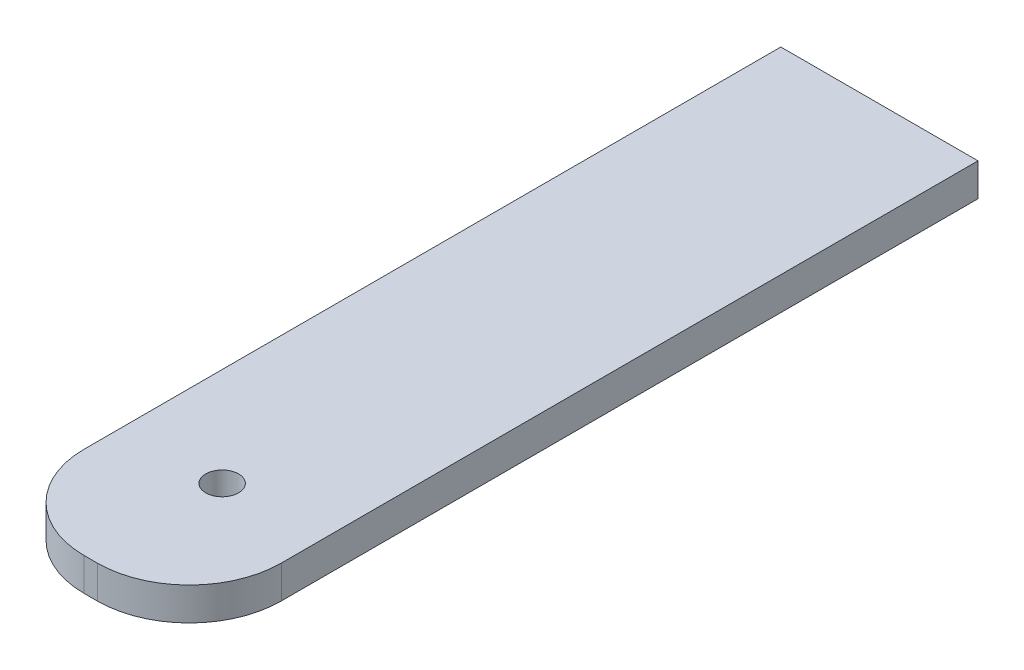
ISO-10303-21;
HEADER;
FILE_DESCRIPTION(('STEP AP214'),'2;1');
FILE_NAME('part.step','',(''),(''),'','','');
FILE_SCHEMA(('AUTOMOTIVE_DESIGN { 1 0 10303 214 1 1 1 1 }'));
ENDSEC;
DATA;
#1=APPLICATION_CONTEXT('core data for automotive mechanical design processes');
#2=APPLICATION_PROTOCOL_DEFINITION('international standard','automotive_design',2000,#1);
#3=PRODUCT_CONTEXT('',#1,'mechanical');
#4=PRODUCT('Part','Part','',(#3));
#5=PRODUCT_RELATED_PRODUCT_CATEGORY('part','',(#4));
#6=PRODUCT_DEFINITION_FORMATION('','',#4);
#7=PRODUCT_DEFINITION_CONTEXT('part definition',#1,'design');
#8=PRODUCT_DEFINITION('design','',#6,#7);
#9=PRODUCT_DEFINITION_SHAPE('','',#8);
#10=(LENGTH_UNIT() NAMED_UNIT(*) SI_UNIT(.MILLI.,.METRE.));
#11=(NAMED_UNIT(*) PLANE_ANGLE_UNIT() SI_UNIT($,.RADIAN.));
#12=(NAMED_UNIT(*) SI_UNIT($,.STERADIAN.) SOLID_ANGLE_UNIT());
#13=UNCERTAINTY_MEASURE_WITH_UNIT(LENGTH_MEASURE(1.E-05),#10,'distance_accuracy_value','');
#14=(GEOMETRIC_REPRESENTATION_CONTEXT(3) GLOBAL_UNCERTAINTY_ASSIGNED_CONTEXT((#13)) GLOBAL_UNIT_ASSIGNED_CONTEXT((#10,
#11,#12)) REPRESENTATION_CONTEXT('',''));
#15=CARTESIAN_POINT('',(0.,0.,0.));
#16=DIRECTION('',(0.,0.,1.));
#17=DIRECTION('',(1.,0.,0.));
#18=AXIS2_PLACEMENT_3D('',#15,#16,#17);
#19=CARTESIAN_POINT('',(-0.634999999999991,3.175,29.21));
#20=DIRECTION('',(0.,1.,0.));
#21=DIRECTION('',(0.,0.,1.));
#22=AXIS2_PLACEMENT_3D('',#19,#20,#21);
#23=CYLINDRICAL_SURFACE('',#22,8.89);
#24=DIRECTION('',(0.,1.,0.));
#25=VECTOR('',#24,1.);
#26=CARTESIAN_POINT('',(-9.52499999999999,3.175,29.21));
#27=LINE('',#26,#25);
#28=CARTESIAN_POINT('',(-9.52499999999999,0.,29.21));
#29=VERTEX_POINT('',#28);
#30=CARTESIAN_POINT('',(-9.52499999999999,3.175,29.21));
#31=VERTEX_POINT('',#30);
#32=EDGE_CURVE('E129',#29,#31,#27,.T.);
#33=ORIENTED_EDGE('',*,*,#32,.F.);
#34=CARTESIAN_POINT('',(-0.634999999999991,0.,29.21));
#35=DIRECTION('',(0.,1.,0.));
#36=DIRECTION('',(0.,0.,1.));
#37=AXIS2_PLACEMENT_3D('',#34,#35,#36);
#38=CIRCLE('',#37,8.89);
#39=CARTESIAN_POINT('',(-0.634999999999988,0.,38.1));
#40=VERTEX_POINT('',#39);
#41=EDGE_CURVE('E40',#40,#29,#38,.F.);
#42=ORIENTED_EDGE('',*,*,#41,.F.);
#43=DIRECTION('',(0.,1.,0.));
#44=VECTOR('',#43,1.);
#45=CARTESIAN_POINT('',(-0.634999999999988,3.175,38.1));
#46=LINE('',#45,#44);
#47=CARTESIAN_POINT('',(-0.634999999999988,3.175,38.1));
#48=VERTEX_POINT('',#47);
#49=EDGE_CURVE('E132',#48,#40,#46,.F.);
#50=ORIENTED_EDGE('',*,*,#49,.F.);
#51=CARTESIAN_POINT('',(-0.634999999999991,3.175,29.21));
#52=DIRECTION('',(0.,1.,0.));
#53=DIRECTION('',(0.,0.,1.));
#54=AXIS2_PLACEMENT_3D('',#51,#52,#53);
#55=CIRCLE('',#54,8.89);
#56=EDGE_CURVE('E11',#31,#48,#55,.T.);
#57=ORIENTED_EDGE('',*,*,#56,.F.);
#58=EDGE_LOOP('',(#33,#42,#50,#57));
#59=FACE_BOUND('',#58,.T.);
#60=ADVANCED_FACE('F33',(#59),#23,.T.);
#61=CARTESIAN_POINT('',(0.635000000000001,3.175,29.21));
#62=DIRECTION('',(0.,-1.,0.));
#63=DIRECTION('',(0.,0.,-1.));
#64=AXIS2_PLACEMENT_3D('',#61,#62,#63);
#65=CYLINDRICAL_SURFACE('',#64,8.89);
#66=DIRECTION('',(0.,-1.,0.));
#67=VECTOR('',#66,1.);
#68=CARTESIAN_POINT('',(9.525,3.175,29.21));
#69=LINE('',#68,#67);
#70=CARTESIAN_POINT('',(9.525,3.175,29.21));
#71=VERTEX_POINT('',#70);
#72=CARTESIAN_POINT('',(9.525,0.,29.21));
#73=VERTEX_POINT('',#72);
#74=EDGE_CURVE('E101',#71,#73,#69,.T.);
#75=ORIENTED_EDGE('',*,*,#74,.F.);
#76=CARTESIAN_POINT('',(0.635000000000001,3.175,29.21));
#77=DIRECTION('',(0.,1.,0.));
#78=DIRECTION('',(0.,0.,1.));
#79=AXIS2_PLACEMENT_3D('',#76,#77,#78);
#80=CIRCLE('',#79,8.89);
#81=CARTESIAN_POINT('',(0.635000000000004,3.175,38.1));
#82=VERTEX_POINT('',#81);
#83=EDGE_CURVE('E88',#82,#71,#80,.T.);
#84=ORIENTED_EDGE('',*,*,#83,.F.);
#85=DIRECTION('',(0.,-1.,0.));
#86=VECTOR('',#85,1.);
#87=CARTESIAN_POINT('',(0.635000000000004,3.175,38.1));
#88=LINE('',#87,#86);
#89=CARTESIAN_POINT('',(0.635000000000004,0.,38.1));
#90=VERTEX_POINT('',#89);
#91=EDGE_CURVE('E122',#90,#82,#88,.F.);
#92=ORIENTED_EDGE('',*,*,#91,.F.);
#93=CARTESIAN_POINT('',(0.635000000000001,0.,29.21));
#94=DIRECTION('',(0.,1.,0.));
#95=DIRECTION('',(0.,0.,1.));
#96=AXIS2_PLACEMENT_3D('',#93,#94,#95);
#97=CIRCLE('',#96,8.89);
#98=EDGE_CURVE('E126',#73,#90,#97,.F.);
#99=ORIENTED_EDGE('',*,*,#98,.F.);
#100=EDGE_LOOP('',(#75,#84,#92,#99));
#101=FACE_BOUND('',#100,.T.);
#102=ADVANCED_FACE('F151',(#101),#65,.T.);
#103=CARTESIAN_POINT('',(0.,3.175,0.));
#104=DIRECTION('',(0.,1.,0.));
#105=DIRECTION('',(0.,0.,1.));
#106=AXIS2_PLACEMENT_3D('',#103,#104,#105);
#107=PLANE('',#106);
#108=DIRECTION('',(0.,0.,1.));
#109=VECTOR('',#108,1.);
#110=CARTESIAN_POINT('',(-9.52500000000001,3.175,-38.1));
#111=LINE('',#110,#109);
#112=CARTESIAN_POINT('',(-9.52500000000001,3.175,-38.1));
#113=VERTEX_POINT('',#112);
#114=EDGE_CURVE('E119',#113,#31,#111,.T.);
#115=ORIENTED_EDGE('',*,*,#114,.T.);
#116=ORIENTED_EDGE('',*,*,#56,.T.);
#117=DIRECTION('',(1.,0.,0.));
#118=VECTOR('',#117,1.);
#119=CARTESIAN_POINT('',(-9.52499999999999,3.175,38.1));
#120=LINE('',#119,#118);
#121=EDGE_CURVE('E92',#48,#82,#120,.T.);
#122=ORIENTED_EDGE('',*,*,#121,.T.);
#123=ORIENTED_EDGE('',*,*,#83,.T.);
#124=DIRECTION('',(0.,0.,-1.));
#125=VECTOR('',#124,1.);
#126=CARTESIAN_POINT('',(9.52499999999999,3.175,-38.1));
#127=LINE('',#126,#125);
#128=CARTESIAN_POINT('',(9.52499999999999,3.175,-38.1));
#129=VERTEX_POINT('',#128);
#130=EDGE_CURVE('E80',#71,#129,#127,.T.);
#131=ORIENTED_EDGE('',*,*,#130,.T.);
#132=DIRECTION('',(-1.,0.,0.));
#133=VECTOR('',#132,1.);
#134=CARTESIAN_POINT('',(-9.52500000000001,3.175,-38.1));
#135=LINE('',#134,#133);
#136=EDGE_CURVE('E85',#129,#113,#135,.T.);
#137=ORIENTED_EDGE('',*,*,#136,.T.);
#138=EDGE_LOOP('',(#115,#116,#122,#123,#131,#137));
#139=FACE_BOUND('',#138,.T.);
#140=CARTESIAN_POINT('',(0.,3.175,25.4));
#141=DIRECTION('',(0.,1.,0.));
#142=DIRECTION('',(0.,0.,1.));
#143=AXIS2_PLACEMENT_3D('',#140,#141,#142);
#144=CIRCLE('',#143,1.5875);
#145=CARTESIAN_POINT('',(0.,3.175,26.9875));
#146=VERTEX_POINT('',#145);
#147=EDGE_CURVE('E115',#146,#146,#144,.T.);
#148=ORIENTED_EDGE('',*,*,#147,.F.);
#149=EDGE_LOOP('',(#148));
#150=FACE_BOUND('',#149,.T.);
#151=ADVANCED_FACE('F82',(#139,#150),#107,.T.);
#152=CARTESIAN_POINT('',(0.,0.,0.));
#153=DIRECTION('',(0.,1.,0.));
#154=DIRECTION('',(0.,0.,1.));
#155=AXIS2_PLACEMENT_3D('',#152,#153,#154);
#156=PLANE('',#155);
#157=DIRECTION('',(1.,0.,0.));
#158=VECTOR('',#157,1.);
#159=CARTESIAN_POINT('',(-9.52499999999999,0.,38.1));
#160=LINE('',#159,#158);
#161=EDGE_CURVE('E114',#40,#90,#160,.T.);
#162=ORIENTED_EDGE('',*,*,#161,.F.);
#163=ORIENTED_EDGE('',*,*,#41,.T.);
#164=DIRECTION('',(0.,0.,1.));
#165=VECTOR('',#164,1.);
#166=CARTESIAN_POINT('',(-9.52500000000001,0.,-38.1));
#167=LINE('',#166,#165);
#168=CARTESIAN_POINT('',(-9.52500000000001,0.,-38.1));
#169=VERTEX_POINT('',#168);
#170=EDGE_CURVE('E111',#169,#29,#167,.T.);
#171=ORIENTED_EDGE('',*,*,#170,.F.);
#172=DIRECTION('',(-1.,0.,0.));
#173=VECTOR('',#172,1.);
#174=CARTESIAN_POINT('',(-9.52500000000001,0.,-38.1));
#175=LINE('',#174,#173);
#176=CARTESIAN_POINT('',(9.52499999999999,0.,-38.1));
#177=VERTEX_POINT('',#176);
#178=EDGE_CURVE('E118',#177,#169,#175,.T.);
#179=ORIENTED_EDGE('',*,*,#178,.F.);
#180=DIRECTION('',(0.,0.,-1.));
#181=VECTOR('',#180,1.);
#182=CARTESIAN_POINT('',(9.52499999999999,0.,-38.1));
#183=LINE('',#182,#181);
#184=EDGE_CURVE('E98',#73,#177,#183,.T.);
#185=ORIENTED_EDGE('',*,*,#184,.F.);
#186=ORIENTED_EDGE('',*,*,#98,.T.);
#187=EDGE_LOOP('',(#162,#163,#171,#179,#185,#186));
#188=FACE_BOUND('',#187,.T.);
#189=CARTESIAN_POINT('',(0.,0.,25.4));
#190=DIRECTION('',(0.,1.,0.));
#191=DIRECTION('',(0.,0.,1.));
#192=AXIS2_PLACEMENT_3D('',#189,#190,#191);
#193=CIRCLE('',#192,1.5875);
#194=CARTESIAN_POINT('',(0.,0.,26.9875));
#195=VERTEX_POINT('',#194);
#196=EDGE_CURVE('E142',#195,#195,#193,.T.);
#197=ORIENTED_EDGE('',*,*,#196,.T.);
#198=EDGE_LOOP('',(#197));
#199=FACE_BOUND('',#198,.T.);
#200=ADVANCED_FACE('F136',(#188,#199),#156,.F.);
#201=CARTESIAN_POINT('',(-9.52500000000001,3.175,-38.1));
#202=DIRECTION('',(1.,0.,0.));
#203=DIRECTION('',(0.,0.,-1.));
#204=AXIS2_PLACEMENT_3D('',#201,#202,#203);
#205=PLANE('',#204);
#206=ORIENTED_EDGE('',*,*,#170,.T.);
#207=ORIENTED_EDGE('',*,*,#32,.T.);
#208=ORIENTED_EDGE('',*,*,#114,.F.);
#209=DIRECTION('',(0.,-1.,0.));
#210=VECTOR('',#209,1.);
#211=CARTESIAN_POINT('',(-9.52500000000001,3.175,-38.1));
#212=LINE('',#211,#210);
#213=EDGE_CURVE('E102',#113,#169,#212,.T.);
#214=ORIENTED_EDGE('',*,*,#213,.T.);
#215=EDGE_LOOP('',(#206,#207,#208,#214));
#216=FACE_BOUND('',#215,.T.);
#217=ADVANCED_FACE('F139',(#216),#205,.F.);
#218=CARTESIAN_POINT('',(-9.52499999999999,3.175,38.1));
#219=DIRECTION('',(0.,0.,-1.));
#220=DIRECTION('',(-1.,0.,0.));
#221=AXIS2_PLACEMENT_3D('',#218,#219,#220);
#222=PLANE('',#221);
#223=ORIENTED_EDGE('',*,*,#121,.F.);
#224=ORIENTED_EDGE('',*,*,#49,.T.);
#225=ORIENTED_EDGE('',*,*,#161,.T.);
#226=ORIENTED_EDGE('',*,*,#91,.T.);
#227=EDGE_LOOP('',(#223,#224,#225,#226));
#228=FACE_BOUND('',#227,.T.);
#229=ADVANCED_FACE('F180',(#228),#222,.F.);
#230=CARTESIAN_POINT('',(9.52499999999999,3.175,-38.1));
#231=DIRECTION('',(-1.,0.,0.));
#232=DIRECTION('',(0.,0.,1.));
#233=AXIS2_PLACEMENT_3D('',#230,#231,#232);
#234=PLANE('',#233);
#235=ORIENTED_EDGE('',*,*,#130,.F.);
#236=ORIENTED_EDGE('',*,*,#74,.T.);
#237=ORIENTED_EDGE('',*,*,#184,.T.);
#238=DIRECTION('',(0.,-1.,0.));
#239=VECTOR('',#238,1.);
#240=CARTESIAN_POINT('',(9.52499999999999,3.175,-38.1));
#241=LINE('',#240,#239);
#242=EDGE_CURVE('E95',#129,#177,#241,.T.);
#243=ORIENTED_EDGE('',*,*,#242,.F.);
#244=EDGE_LOOP('',(#235,#236,#237,#243));
#245=FACE_BOUND('',#244,.T.);
#246=ADVANCED_FACE('F96',(#245),#234,.F.);
#247=CARTESIAN_POINT('',(-9.52500000000001,3.175,-38.1));
#248=DIRECTION('',(0.,0.,1.));
#249=DIRECTION('',(1.,0.,0.));
#250=AXIS2_PLACEMENT_3D('',#247,#248,#249);
#251=PLANE('',#250);
#252=ORIENTED_EDGE('',*,*,#178,.T.);
#253=ORIENTED_EDGE('',*,*,#213,.F.);
#254=ORIENTED_EDGE('',*,*,#136,.F.);
#255=ORIENTED_EDGE('',*,*,#242,.T.);
#256=EDGE_LOOP('',(#252,#253,#254,#255));
#257=FACE_BOUND('',#256,.T.);
#258=ADVANCED_FACE('F104',(#257),#251,.F.);
#259=CARTESIAN_POINT('',(0.,3.175,25.4));
#260=DIRECTION('',(0.,-1.,0.));
#261=DIRECTION('',(0.,0.,-1.));
#262=AXIS2_PLACEMENT_3D('',#259,#260,#261);
#263=CYLINDRICAL_SURFACE('',#262,1.5875);
#264=ORIENTED_EDGE('',*,*,#147,.T.);
#265=EDGE_LOOP('',(#264));
#266=FACE_BOUND('',#265,.T.);
#267=ORIENTED_EDGE('',*,*,#196,.F.);
#268=EDGE_LOOP('',(#267));
#269=FACE_BOUND('',#268,.T.);
#270=ADVANCED_FACE('F148',(#266,#269),#263,.F.);
#271=CLOSED_SHELL('',(#60,#102,#151,#200,#217,#229,#246,#258,#270));
#272=MANIFOLD_SOLID_BREP('B2',#271);
#273=ADVANCED_BREP_SHAPE_REPRESENTATION('',(#18,#272),#14);
#274=SHAPE_DEFINITION_REPRESENTATION(#9,#273);
ENDSEC;
END-ISO-10303-21;
